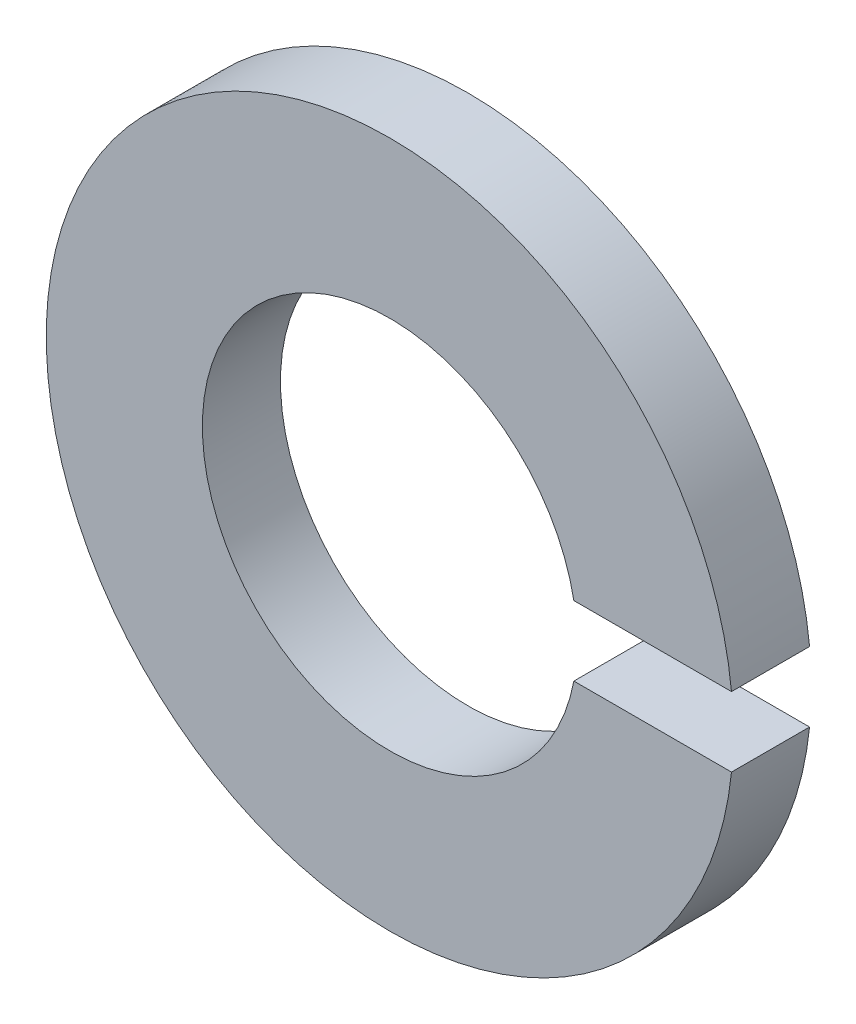
ISO-10303-21;
HEADER;
FILE_DESCRIPTION(('STEP AP214'),'2;1');
FILE_NAME('part.step','',(''),(''),'','','');
FILE_SCHEMA(('AUTOMOTIVE_DESIGN { 1 0 10303 214 1 1 1 1 }'));
ENDSEC;
DATA;
#1=APPLICATION_CONTEXT('core data for automotive mechanical design processes');
#2=APPLICATION_PROTOCOL_DEFINITION('international standard','automotive_design',2000,#1);
#3=PRODUCT_CONTEXT('',#1,'mechanical');
#4=PRODUCT('Part','Part','',(#3));
#5=PRODUCT_RELATED_PRODUCT_CATEGORY('part','',(#4));
#6=PRODUCT_DEFINITION_FORMATION('','',#4);
#7=PRODUCT_DEFINITION_CONTEXT('part definition',#1,'design');
#8=PRODUCT_DEFINITION('design','',#6,#7);
#9=PRODUCT_DEFINITION_SHAPE('','',#8);
#10=(LENGTH_UNIT() NAMED_UNIT(*) SI_UNIT(.MILLI.,.METRE.));
#11=(NAMED_UNIT(*) PLANE_ANGLE_UNIT() SI_UNIT($,.RADIAN.));
#12=(NAMED_UNIT(*) SI_UNIT($,.STERADIAN.) SOLID_ANGLE_UNIT());
#13=UNCERTAINTY_MEASURE_WITH_UNIT(LENGTH_MEASURE(1.E-05),#10,'distance_accuracy_value','');
#14=(GEOMETRIC_REPRESENTATION_CONTEXT(3) GLOBAL_UNCERTAINTY_ASSIGNED_CONTEXT((#13)) GLOBAL_UNIT_ASSIGNED_CONTEXT((#10,
#11,#12)) REPRESENTATION_CONTEXT('',''));
#15=CARTESIAN_POINT('',(0.,0.,0.));
#16=DIRECTION('',(0.,0.,1.));
#17=DIRECTION('',(1.,0.,0.));
#18=AXIS2_PLACEMENT_3D('',#15,#16,#17);
#19=CARTESIAN_POINT('',(0.,0.,0.5));
#20=DIRECTION('',(0.,0.,1.));
#21=DIRECTION('',(1.,0.,0.));
#22=AXIS2_PLACEMENT_3D('',#19,#20,#21);
#23=PLANE('',#22);
#24=CARTESIAN_POINT('',(0.,0.,0.5));
#25=DIRECTION('',(0.,0.,-1.));
#26=DIRECTION('',(-1.,0.,0.));
#27=AXIS2_PLACEMENT_3D('',#24,#25,#26);
#28=CIRCLE('',#27,1.2);
#29=CARTESIAN_POINT('',(1.17906811769047,-0.223155492528984,0.5));
#30=VERTEX_POINT('',#29);
#31=CARTESIAN_POINT('',(1.17906811769047,0.223155492528984,0.5));
#32=VERTEX_POINT('',#31);
#33=EDGE_CURVE('E20',#30,#32,#28,.T.);
#34=ORIENTED_EDGE('',*,*,#33,.T.);
#35=DIRECTION('',(1.,0.,0.));
#36=VECTOR('',#35,1.);
#37=CARTESIAN_POINT('',(1.17906811769047,0.223155492528984,0.5));
#38=LINE('',#37,#36);
#39=CARTESIAN_POINT('',(2.18865292500984,0.223155492528984,0.5));
#40=VERTEX_POINT('',#39);
#41=EDGE_CURVE('E57',#32,#40,#38,.T.);
#42=ORIENTED_EDGE('',*,*,#41,.T.);
#43=CARTESIAN_POINT('',(0.,0.,0.5));
#44=DIRECTION('',(0.,0.,-1.));
#45=DIRECTION('',(-1.,0.,0.));
#46=AXIS2_PLACEMENT_3D('',#43,#44,#45);
#47=CIRCLE('',#46,2.2);
#48=CARTESIAN_POINT('',(2.18865292500984,-0.223155492528984,0.5));
#49=VERTEX_POINT('',#48);
#50=EDGE_CURVE('E82',#49,#40,#47,.T.);
#51=ORIENTED_EDGE('',*,*,#50,.F.);
#52=DIRECTION('',(1.,0.,0.));
#53=VECTOR('',#52,1.);
#54=CARTESIAN_POINT('',(0.,-0.223155492528984,0.5));
#55=LINE('',#54,#53);
#56=EDGE_CURVE('E59',#49,#30,#55,.F.);
#57=ORIENTED_EDGE('',*,*,#56,.T.);
#58=EDGE_LOOP('',(#34,#42,#51,#57));
#59=FACE_BOUND('',#58,.T.);
#60=ADVANCED_FACE('F17',(#59),#23,.T.);
#61=CARTESIAN_POINT('',(0.,0.,0.5));
#62=DIRECTION('',(0.,0.,-1.));
#63=DIRECTION('',(-1.,0.,0.));
#64=AXIS2_PLACEMENT_3D('',#61,#62,#63);
#65=CYLINDRICAL_SURFACE('',#64,1.2);
#66=ORIENTED_EDGE('',*,*,#33,.F.);
#67=DIRECTION('',(0.,0.,-1.));
#68=VECTOR('',#67,1.);
#69=CARTESIAN_POINT('',(1.17906811769047,-0.223155492528984,0.5));
#70=LINE('',#69,#68);
#71=CARTESIAN_POINT('',(1.17906811769047,-0.223155492528984,0.));
#72=VERTEX_POINT('',#71);
#73=EDGE_CURVE('E81',#30,#72,#70,.T.);
#74=ORIENTED_EDGE('',*,*,#73,.T.);
#75=CARTESIAN_POINT('',(0.,0.,0.));
#76=DIRECTION('',(0.,0.,-1.));
#77=DIRECTION('',(-1.,0.,0.));
#78=AXIS2_PLACEMENT_3D('',#75,#76,#77);
#79=CIRCLE('',#78,1.2);
#80=CARTESIAN_POINT('',(1.17906811769047,0.223155492528984,0.));
#81=VERTEX_POINT('',#80);
#82=EDGE_CURVE('E73',#72,#81,#79,.T.);
#83=ORIENTED_EDGE('',*,*,#82,.T.);
#84=DIRECTION('',(0.,0.,1.));
#85=VECTOR('',#84,1.);
#86=CARTESIAN_POINT('',(1.17906811769047,0.223155492528984,0.5));
#87=LINE('',#86,#85);
#88=EDGE_CURVE('E64',#81,#32,#87,.T.);
#89=ORIENTED_EDGE('',*,*,#88,.T.);
#90=EDGE_LOOP('',(#66,#74,#83,#89));
#91=FACE_BOUND('',#90,.T.);
#92=ADVANCED_FACE('F72',(#91),#65,.F.);
#93=CARTESIAN_POINT('',(1.17906811769047,0.223155492528984,0.5));
#94=DIRECTION('',(0.,1.,0.));
#95=DIRECTION('',(0.,0.,1.));
#96=AXIS2_PLACEMENT_3D('',#93,#94,#95);
#97=PLANE('',#96);
#98=ORIENTED_EDGE('',*,*,#41,.F.);
#99=ORIENTED_EDGE('',*,*,#88,.F.);
#100=DIRECTION('',(1.,0.,0.));
#101=VECTOR('',#100,1.);
#102=CARTESIAN_POINT('',(0.,0.223155492528984,0.));
#103=LINE('',#102,#101);
#104=CARTESIAN_POINT('',(2.18865292500984,0.223155492528984,0.));
#105=VERTEX_POINT('',#104);
#106=EDGE_CURVE('E80',#81,#105,#103,.T.);
#107=ORIENTED_EDGE('',*,*,#106,.T.);
#108=DIRECTION('',(0.,0.,-1.));
#109=VECTOR('',#108,1.);
#110=CARTESIAN_POINT('',(2.18865292500984,0.223155492528984,0.5));
#111=LINE('',#110,#109);
#112=EDGE_CURVE('E70',#40,#105,#111,.T.);
#113=ORIENTED_EDGE('',*,*,#112,.F.);
#114=EDGE_LOOP('',(#98,#99,#107,#113));
#115=FACE_BOUND('',#114,.T.);
#116=ADVANCED_FACE('F67',(#115),#97,.F.);
#117=CARTESIAN_POINT('',(0.,0.,0.5));
#118=DIRECTION('',(0.,0.,-1.));
#119=DIRECTION('',(-1.,0.,0.));
#120=AXIS2_PLACEMENT_3D('',#117,#118,#119);
#121=CYLINDRICAL_SURFACE('',#120,2.2);
#122=CARTESIAN_POINT('',(0.,0.,0.));
#123=DIRECTION('',(0.,0.,-1.));
#124=DIRECTION('',(-1.,0.,0.));
#125=AXIS2_PLACEMENT_3D('',#122,#123,#124);
#126=CIRCLE('',#125,2.2);
#127=CARTESIAN_POINT('',(2.18865292500984,-0.223155492528984,0.));
#128=VERTEX_POINT('',#127);
#129=EDGE_CURVE('E26',#105,#128,#126,.F.);
#130=ORIENTED_EDGE('',*,*,#129,.T.);
#131=DIRECTION('',(0.,0.,-1.));
#132=VECTOR('',#131,1.);
#133=CARTESIAN_POINT('',(2.18865292500984,-0.223155492528984,0.5));
#134=LINE('',#133,#132);
#135=EDGE_CURVE('E83',#128,#49,#134,.F.);
#136=ORIENTED_EDGE('',*,*,#135,.T.);
#137=ORIENTED_EDGE('',*,*,#50,.T.);
#138=ORIENTED_EDGE('',*,*,#112,.T.);
#139=EDGE_LOOP('',(#130,#136,#137,#138));
#140=FACE_BOUND('',#139,.T.);
#141=ADVANCED_FACE('F85',(#140),#121,.T.);
#142=CARTESIAN_POINT('',(1.17906811769047,-0.223155492528984,0.5));
#143=DIRECTION('',(0.,-1.,0.));
#144=DIRECTION('',(0.,0.,-1.));
#145=AXIS2_PLACEMENT_3D('',#142,#143,#144);
#146=PLANE('',#145);
#147=ORIENTED_EDGE('',*,*,#56,.F.);
#148=ORIENTED_EDGE('',*,*,#135,.F.);
#149=DIRECTION('',(1.,0.,0.));
#150=VECTOR('',#149,1.);
#151=CARTESIAN_POINT('',(0.,-0.223155492528984,0.));
#152=LINE('',#151,#150);
#153=EDGE_CURVE('E11',#128,#72,#152,.F.);
#154=ORIENTED_EDGE('',*,*,#153,.T.);
#155=ORIENTED_EDGE('',*,*,#73,.F.);
#156=EDGE_LOOP('',(#147,#148,#154,#155));
#157=FACE_BOUND('',#156,.T.);
#158=ADVANCED_FACE('F91',(#157),#146,.F.);
#159=CARTESIAN_POINT('',(0.,0.,0.));
#160=DIRECTION('',(0.,0.,1.));
#161=DIRECTION('',(1.,0.,0.));
#162=AXIS2_PLACEMENT_3D('',#159,#160,#161);
#163=PLANE('',#162);
#164=ORIENTED_EDGE('',*,*,#153,.F.);
#165=ORIENTED_EDGE('',*,*,#129,.F.);
#166=ORIENTED_EDGE('',*,*,#106,.F.);
#167=ORIENTED_EDGE('',*,*,#82,.F.);
#168=EDGE_LOOP('',(#164,#165,#166,#167));
#169=FACE_BOUND('',#168,.T.);
#170=ADVANCED_FACE('F88',(#169),#163,.F.);
#171=CLOSED_SHELL('',(#60,#92,#116,#141,#158,#170));
#172=MANIFOLD_SOLID_BREP('B1',#171);
#173=ADVANCED_BREP_SHAPE_REPRESENTATION('',(#18,#172),#14);
#174=SHAPE_DEFINITION_REPRESENTATION(#9,#173);
ENDSEC;
END-ISO-10303-21;
